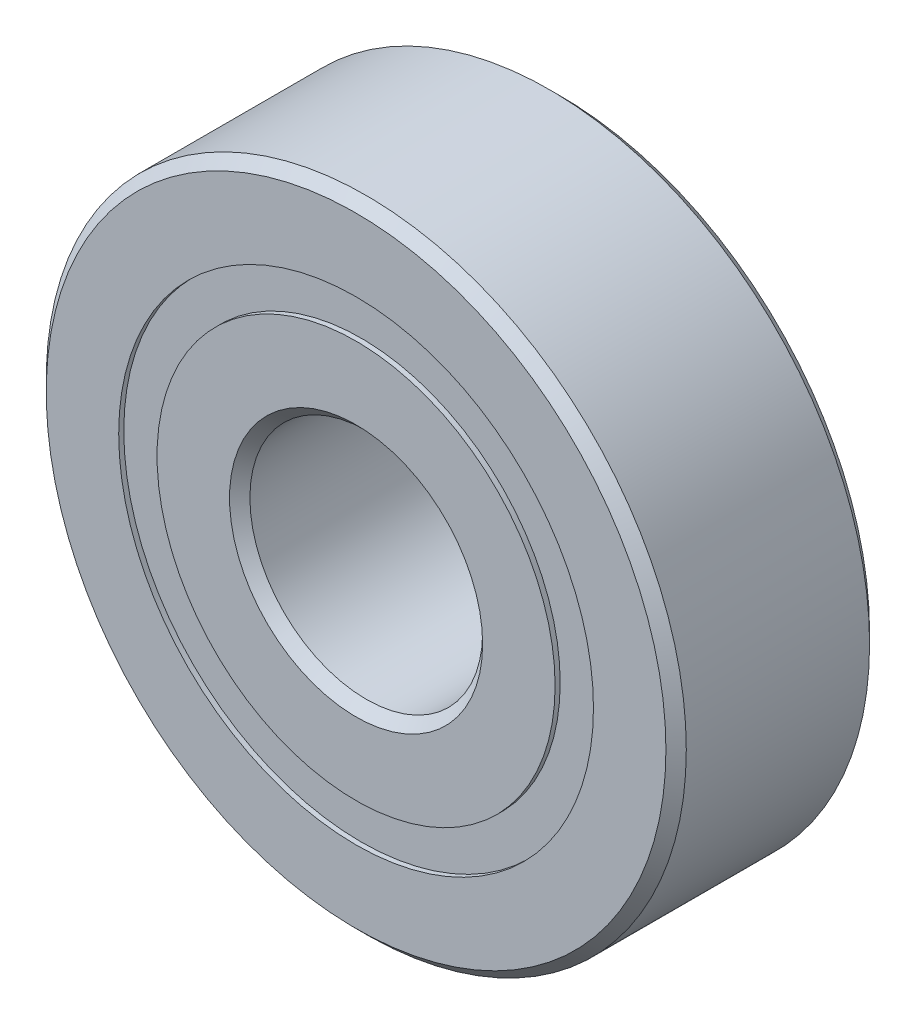
ISO-10303-21;
HEADER;
FILE_DESCRIPTION(('STEP AP214'),'2;1');
FILE_NAME('part.step','',(''),(''),'','','');
FILE_SCHEMA(('AUTOMOTIVE_DESIGN { 1 0 10303 214 1 1 1 1 }'));
ENDSEC;
DATA;
#1=APPLICATION_CONTEXT('core data for automotive mechanical design processes');
#2=APPLICATION_PROTOCOL_DEFINITION('international standard','automotive_design',2000,#1);
#3=PRODUCT_CONTEXT('',#1,'mechanical');
#4=PRODUCT('Part','Part','',(#3));
#5=PRODUCT_RELATED_PRODUCT_CATEGORY('part','',(#4));
#6=PRODUCT_DEFINITION_FORMATION('','',#4);
#7=PRODUCT_DEFINITION_CONTEXT('part definition',#1,'design');
#8=PRODUCT_DEFINITION('design','',#6,#7);
#9=PRODUCT_DEFINITION_SHAPE('','',#8);
#10=(LENGTH_UNIT() NAMED_UNIT(*) SI_UNIT(.MILLI.,.METRE.));
#11=(NAMED_UNIT(*) PLANE_ANGLE_UNIT() SI_UNIT($,.RADIAN.));
#12=(NAMED_UNIT(*) SI_UNIT($,.STERADIAN.) SOLID_ANGLE_UNIT());
#13=UNCERTAINTY_MEASURE_WITH_UNIT(LENGTH_MEASURE(1.E-05),#10,'distance_accuracy_value','');
#14=(GEOMETRIC_REPRESENTATION_CONTEXT(3) GLOBAL_UNCERTAINTY_ASSIGNED_CONTEXT((#13)) GLOBAL_UNIT_ASSIGNED_CONTEXT((#10,
#11,#12)) REPRESENTATION_CONTEXT('',''));
#15=CARTESIAN_POINT('',(0.,0.,0.));
#16=DIRECTION('',(0.,0.,1.));
#17=DIRECTION('',(1.,0.,0.));
#18=AXIS2_PLACEMENT_3D('',#15,#16,#17);
#19=CARTESIAN_POINT('',(0.,8.15934065934066,-3.325));
#20=DIRECTION('',(0.,0.,1.));
#21=DIRECTION('',(1.,0.,0.));
#22=AXIS2_PLACEMENT_3D('',#19,#20,#21);
#23=PLANE('',#22);
#24=CARTESIAN_POINT('',(0.,0.,-3.325));
#25=DIRECTION('',(0.,0.,1.));
#26=DIRECTION('',(1.,0.,0.));
#27=AXIS2_PLACEMENT_3D('',#24,#25,#26);
#28=CIRCLE('',#27,8.15934065934066);
#29=CARTESIAN_POINT('',(8.15934065934066,0.,-3.325));
#30=VERTEX_POINT('',#29);
#31=EDGE_CURVE('E57',#30,#30,#28,.T.);
#32=ORIENTED_EDGE('',*,*,#31,.F.);
#33=EDGE_LOOP('',(#32));
#34=FACE_BOUND('',#33,.T.);
#35=CARTESIAN_POINT('',(0.,0.,-3.325));
#36=DIRECTION('',(0.,0.,1.));
#37=DIRECTION('',(1.,0.,0.));
#38=AXIS2_PLACEMENT_3D('',#35,#36,#37);
#39=CIRCLE('',#38,6.84065934065934);
#40=CARTESIAN_POINT('',(6.84065934065934,0.,-3.325));
#41=VERTEX_POINT('',#40);
#42=EDGE_CURVE('E11',#41,#41,#39,.T.);
#43=ORIENTED_EDGE('',*,*,#42,.T.);
#44=EDGE_LOOP('',(#43));
#45=FACE_BOUND('',#44,.T.);
#46=ADVANCED_FACE('F43',(#34,#45),#23,.F.);
#47=CARTESIAN_POINT('',(0.,0.,3.5));
#48=DIRECTION('',(0.,0.,1.));
#49=DIRECTION('',(1.,0.,0.));
#50=AXIS2_PLACEMENT_3D('',#47,#48,#49);
#51=CYLINDRICAL_SURFACE('',#50,6.84065934065934);
#52=ORIENTED_EDGE('',*,*,#42,.F.);
#53=EDGE_LOOP('',(#52));
#54=FACE_BOUND('',#53,.T.);
#55=CARTESIAN_POINT('',(0.,0.,-1.68952158656808));
#56=DIRECTION('',(0.,0.,1.));
#57=DIRECTION('',(1.,0.,0.));
#58=AXIS2_PLACEMENT_3D('',#55,#56,#57);
#59=CIRCLE('',#58,6.84065934065934);
#60=CARTESIAN_POINT('',(6.84065934065934,0.,-1.68952158656808));
#61=VERTEX_POINT('',#60);
#62=EDGE_CURVE('E49',#61,#61,#59,.T.);
#63=ORIENTED_EDGE('',*,*,#62,.T.);
#64=EDGE_LOOP('',(#63));
#65=FACE_BOUND('',#64,.T.);
#66=ADVANCED_FACE('F66',(#54,#65),#51,.F.);
#67=CARTESIAN_POINT('',(0.,8.15934065934066,-1.68952158656808));
#68=DIRECTION('',(0.,0.,-1.));
#69=DIRECTION('',(-1.,0.,0.));
#70=AXIS2_PLACEMENT_3D('',#67,#68,#69);
#71=PLANE('',#70);
#72=ORIENTED_EDGE('',*,*,#62,.F.);
#73=EDGE_LOOP('',(#72));
#74=FACE_BOUND('',#73,.T.);
#75=CARTESIAN_POINT('',(0.,0.,-1.68952158656808));
#76=DIRECTION('',(0.,0.,1.));
#77=DIRECTION('',(1.,0.,0.));
#78=AXIS2_PLACEMENT_3D('',#75,#76,#77);
#79=CIRCLE('',#78,8.15934065934066);
#80=CARTESIAN_POINT('',(8.15934065934066,0.,-1.68952158656808));
#81=VERTEX_POINT('',#80);
#82=EDGE_CURVE('E53',#81,#81,#79,.T.);
#83=ORIENTED_EDGE('',*,*,#82,.T.);
#84=EDGE_LOOP('',(#83));
#85=FACE_BOUND('',#84,.T.);
#86=ADVANCED_FACE('F70',(#74,#85),#71,.F.);
#87=CARTESIAN_POINT('',(0.,0.,3.5));
#88=DIRECTION('',(0.,0.,1.));
#89=DIRECTION('',(1.,0.,0.));
#90=AXIS2_PLACEMENT_3D('',#87,#88,#89);
#91=CYLINDRICAL_SURFACE('',#90,8.15934065934066);
#92=ORIENTED_EDGE('',*,*,#82,.F.);
#93=EDGE_LOOP('',(#92));
#94=FACE_BOUND('',#93,.T.);
#95=ORIENTED_EDGE('',*,*,#31,.T.);
#96=EDGE_LOOP('',(#95));
#97=FACE_BOUND('',#96,.T.);
#98=ADVANCED_FACE('F63',(#94,#97),#91,.T.);
#99=CLOSED_SHELL('',(#46,#66,#86,#98));
#100=MANIFOLD_SOLID_BREP('B2',#99);
#101=CARTESIAN_POINT('',(0.,8.15934065934066,3.325));
#102=DIRECTION('',(0.,0.,-1.));
#103=DIRECTION('',(-1.,0.,0.));
#104=AXIS2_PLACEMENT_3D('',#101,#102,#103);
#105=PLANE('',#104);
#106=CARTESIAN_POINT('',(0.,0.,3.325));
#107=DIRECTION('',(0.,0.,1.));
#108=DIRECTION('',(1.,0.,0.));
#109=AXIS2_PLACEMENT_3D('',#106,#107,#108);
#110=CIRCLE('',#109,6.84065934065934);
#111=CARTESIAN_POINT('',(6.84065934065934,0.,3.325));
#112=VERTEX_POINT('',#111);
#113=EDGE_CURVE('E42',#112,#112,#110,.T.);
#114=ORIENTED_EDGE('',*,*,#113,.F.);
#115=EDGE_LOOP('',(#114));
#116=FACE_BOUND('',#115,.T.);
#117=CARTESIAN_POINT('',(0.,0.,3.325));
#118=DIRECTION('',(0.,0.,1.));
#119=DIRECTION('',(1.,0.,0.));
#120=AXIS2_PLACEMENT_3D('',#117,#118,#119);
#121=CIRCLE('',#120,8.15934065934066);
#122=CARTESIAN_POINT('',(8.15934065934066,0.,3.325));
#123=VERTEX_POINT('',#122);
#124=EDGE_CURVE('E124',#123,#123,#121,.T.);
#125=ORIENTED_EDGE('',*,*,#124,.T.);
#126=EDGE_LOOP('',(#125));
#127=FACE_BOUND('',#126,.T.);
#128=ADVANCED_FACE('F110',(#116,#127),#105,.F.);
#129=CARTESIAN_POINT('',(0.,0.,3.5));
#130=DIRECTION('',(0.,0.,1.));
#131=DIRECTION('',(1.,0.,0.));
#132=AXIS2_PLACEMENT_3D('',#129,#130,#131);
#133=CYLINDRICAL_SURFACE('',#132,6.84065934065934);
#134=CARTESIAN_POINT('',(0.,0.,1.68952158656808));
#135=DIRECTION('',(0.,0.,1.));
#136=DIRECTION('',(1.,0.,0.));
#137=AXIS2_PLACEMENT_3D('',#134,#135,#136);
#138=CIRCLE('',#137,6.84065934065934);
#139=CARTESIAN_POINT('',(6.84065934065934,0.,1.68952158656808));
#140=VERTEX_POINT('',#139);
#141=EDGE_CURVE('E116',#140,#140,#138,.T.);
#142=ORIENTED_EDGE('',*,*,#141,.F.);
#143=EDGE_LOOP('',(#142));
#144=FACE_BOUND('',#143,.T.);
#145=ORIENTED_EDGE('',*,*,#113,.T.);
#146=EDGE_LOOP('',(#145));
#147=FACE_BOUND('',#146,.T.);
#148=ADVANCED_FACE('F139',(#144,#147),#133,.F.);
#149=CARTESIAN_POINT('',(0.,8.15934065934066,1.68952158656808));
#150=DIRECTION('',(0.,0.,1.));
#151=DIRECTION('',(1.,0.,0.));
#152=AXIS2_PLACEMENT_3D('',#149,#150,#151);
#153=PLANE('',#152);
#154=CARTESIAN_POINT('',(0.,0.,1.68952158656808));
#155=DIRECTION('',(0.,0.,1.));
#156=DIRECTION('',(1.,0.,0.));
#157=AXIS2_PLACEMENT_3D('',#154,#155,#156);
#158=CIRCLE('',#157,8.15934065934066);
#159=CARTESIAN_POINT('',(8.15934065934066,0.,1.68952158656808));
#160=VERTEX_POINT('',#159);
#161=EDGE_CURVE('E120',#160,#160,#158,.T.);
#162=ORIENTED_EDGE('',*,*,#161,.F.);
#163=EDGE_LOOP('',(#162));
#164=FACE_BOUND('',#163,.T.);
#165=ORIENTED_EDGE('',*,*,#141,.T.);
#166=EDGE_LOOP('',(#165));
#167=FACE_BOUND('',#166,.T.);
#168=ADVANCED_FACE('F134',(#164,#167),#153,.F.);
#169=CARTESIAN_POINT('',(0.,0.,3.5));
#170=DIRECTION('',(0.,0.,1.));
#171=DIRECTION('',(1.,0.,0.));
#172=AXIS2_PLACEMENT_3D('',#169,#170,#171);
#173=CYLINDRICAL_SURFACE('',#172,8.15934065934066);
#174=ORIENTED_EDGE('',*,*,#124,.F.);
#175=EDGE_LOOP('',(#174));
#176=FACE_BOUND('',#175,.T.);
#177=ORIENTED_EDGE('',*,*,#161,.T.);
#178=EDGE_LOOP('',(#177));
#179=FACE_BOUND('',#178,.T.);
#180=ADVANCED_FACE('F131',(#176,#179),#173,.T.);
#181=CLOSED_SHELL('',(#128,#148,#168,#180));
#182=MANIFOLD_SOLID_BREP('B6',#181);
#183=CARTESIAN_POINT('',(-3.74999999999992,6.49519052838334,0.));
#184=DIRECTION('',(0.,0.,1.));
#185=DIRECTION('',(-0.499999999999989,0.866025403784445,0.));
#186=AXIS2_PLACEMENT_3D('',#183,#184,#185);
#187=SPHERICAL_SURFACE('',#186,1.68952158656808);
#188=CARTESIAN_POINT('',(-3.74999999999992,6.49519052838334,1.68952158656808));
#189=VERTEX_POINT('',#188);
#190=VERTEX_LOOP('',#189);
#191=FACE_BOUND('',#190,.T.);
#192=ADVANCED_FACE('F177',(#191),#187,.T.);
#193=CLOSED_SHELL('',(#192));
#194=MANIFOLD_SOLID_BREP('B37',#193);
#195=CARTESIAN_POINT('',(-6.49519052838325,3.75000000000008,0.));
#196=DIRECTION('',(0.,0.,1.));
#197=DIRECTION('',(-0.866025403784433,0.50000000000001,0.));
#198=AXIS2_PLACEMENT_3D('',#195,#196,#197);
#199=SPHERICAL_SURFACE('',#198,1.68952158656808);
#200=CARTESIAN_POINT('',(-6.49519052838325,3.75000000000008,1.68952158656808));
#201=VERTEX_POINT('',#200);
#202=VERTEX_LOOP('',#201);
#203=FACE_BOUND('',#202,.T.);
#204=ADVANCED_FACE('F197',(#203),#199,.T.);
#205=CLOSED_SHELL('',(#204));
#206=MANIFOLD_SOLID_BREP('B106',#205);
#207=CARTESIAN_POINT('',(-7.5,0.,0.));
#208=DIRECTION('',(0.,0.,1.));
#209=DIRECTION('',(-1.,0.,0.));
#210=AXIS2_PLACEMENT_3D('',#207,#208,#209);
#211=SPHERICAL_SURFACE('',#210,1.68952158656808);
#212=CARTESIAN_POINT('',(-7.5,0.,1.68952158656808));
#213=VERTEX_POINT('',#212);
#214=VERTEX_LOOP('',#213);
#215=FACE_BOUND('',#214,.T.);
#216=ADVANCED_FACE('F217',(#215),#211,.T.);
#217=CLOSED_SHELL('',(#216));
#218=MANIFOLD_SOLID_BREP('B173',#217);
#219=CARTESIAN_POINT('',(-6.49519052838332,-3.74999999999994,0.));
#220=DIRECTION('',(0.,0.,1.));
#221=DIRECTION('',(-0.866025403784443,-0.499999999999992,0.));
#222=AXIS2_PLACEMENT_3D('',#219,#220,#221);
#223=SPHERICAL_SURFACE('',#222,1.68952158656808);
#224=CARTESIAN_POINT('',(-6.49519052838332,-3.74999999999994,1.68952158656808));
#225=VERTEX_POINT('',#224);
#226=VERTEX_LOOP('',#225);
#227=FACE_BOUND('',#226,.T.);
#228=ADVANCED_FACE('F237',(#227),#223,.T.);
#229=CLOSED_SHELL('',(#228));
#230=MANIFOLD_SOLID_BREP('B193',#229);
#231=CARTESIAN_POINT('',(-3.75000000000005,-6.49519052838326,0.));
#232=DIRECTION('',(0.,0.,1.));
#233=DIRECTION('',(-0.500000000000007,-0.866025403784435,0.));
#234=AXIS2_PLACEMENT_3D('',#231,#232,#233);
#235=SPHERICAL_SURFACE('',#234,1.68952158656808);
#236=CARTESIAN_POINT('',(-3.75000000000005,-6.49519052838326,1.68952158656808));
#237=VERTEX_POINT('',#236);
#238=VERTEX_LOOP('',#237);
#239=FACE_BOUND('',#238,.T.);
#240=ADVANCED_FACE('F257',(#239),#235,.T.);
#241=CLOSED_SHELL('',(#240));
#242=MANIFOLD_SOLID_BREP('B213',#241);
#243=CARTESIAN_POINT('',(0.,-7.5,0.));
#244=DIRECTION('',(0.,0.,1.));
#245=DIRECTION('',(0.,-1.,0.));
#246=AXIS2_PLACEMENT_3D('',#243,#244,#245);
#247=SPHERICAL_SURFACE('',#246,1.68952158656808);
#248=CARTESIAN_POINT('',(0.,-7.5,1.68952158656808));
#249=VERTEX_POINT('',#248);
#250=VERTEX_LOOP('',#249);
#251=FACE_BOUND('',#250,.T.);
#252=ADVANCED_FACE('F277',(#251),#247,.T.);
#253=CLOSED_SHELL('',(#252));
#254=MANIFOLD_SOLID_BREP('B233',#253);
#255=CARTESIAN_POINT('',(3.74999999999996,-6.49519052838331,0.));
#256=DIRECTION('',(0.,0.,1.));
#257=DIRECTION('',(0.499999999999995,-0.866025403784442,0.));
#258=AXIS2_PLACEMENT_3D('',#255,#256,#257);
#259=SPHERICAL_SURFACE('',#258,1.68952158656808);
#260=CARTESIAN_POINT('',(3.74999999999996,-6.49519052838331,1.68952158656808));
#261=VERTEX_POINT('',#260);
#262=VERTEX_LOOP('',#261);
#263=FACE_BOUND('',#262,.T.);
#264=ADVANCED_FACE('F297',(#263),#259,.T.);
#265=CLOSED_SHELL('',(#264));
#266=MANIFOLD_SOLID_BREP('B253',#265);
#267=CARTESIAN_POINT('',(6.49519052838327,-3.75000000000003,0.));
#268=DIRECTION('',(0.,0.,1.));
#269=DIRECTION('',(0.866025403784436,-0.500000000000004,0.));
#270=AXIS2_PLACEMENT_3D('',#267,#268,#269);
#271=SPHERICAL_SURFACE('',#270,1.68952158656808);
#272=CARTESIAN_POINT('',(6.49519052838327,-3.75000000000003,1.68952158656808));
#273=VERTEX_POINT('',#272);
#274=VERTEX_LOOP('',#273);
#275=FACE_BOUND('',#274,.T.);
#276=ADVANCED_FACE('F317',(#275),#271,.T.);
#277=CLOSED_SHELL('',(#276));
#278=MANIFOLD_SOLID_BREP('B273',#277);
#279=CARTESIAN_POINT('',(7.5,0.,0.));
#280=DIRECTION('',(0.,0.,1.));
#281=DIRECTION('',(1.,0.,0.));
#282=AXIS2_PLACEMENT_3D('',#279,#280,#281);
#283=SPHERICAL_SURFACE('',#282,1.68952158656808);
#284=CARTESIAN_POINT('',(7.5,0.,1.68952158656808));
#285=VERTEX_POINT('',#284);
#286=VERTEX_LOOP('',#285);
#287=FACE_BOUND('',#286,.T.);
#288=ADVANCED_FACE('F337',(#287),#283,.T.);
#289=CLOSED_SHELL('',(#288));
#290=MANIFOLD_SOLID_BREP('B293',#289);
#291=CARTESIAN_POINT('',(6.4951905283833,3.74999999999998,0.));
#292=DIRECTION('',(0.,0.,1.));
#293=DIRECTION('',(0.86602540378444,0.499999999999998,0.));
#294=AXIS2_PLACEMENT_3D('',#291,#292,#293);
#295=SPHERICAL_SURFACE('',#294,1.68952158656808);
#296=CARTESIAN_POINT('',(6.4951905283833,3.74999999999998,1.68952158656808));
#297=VERTEX_POINT('',#296);
#298=VERTEX_LOOP('',#297);
#299=FACE_BOUND('',#298,.T.);
#300=ADVANCED_FACE('F357',(#299),#295,.T.);
#301=CLOSED_SHELL('',(#300));
#302=MANIFOLD_SOLID_BREP('B313',#301);
#303=CARTESIAN_POINT('',(3.75000000000001,6.49519052838328,0.));
#304=DIRECTION('',(0.,0.,1.));
#305=DIRECTION('',(0.500000000000001,0.866025403784438,0.));
#306=AXIS2_PLACEMENT_3D('',#303,#304,#305);
#307=SPHERICAL_SURFACE('',#306,1.68952158656808);
#308=CARTESIAN_POINT('',(3.75000000000001,6.49519052838328,1.68952158656808));
#309=VERTEX_POINT('',#308);
#310=VERTEX_LOOP('',#309);
#311=FACE_BOUND('',#310,.T.);
#312=ADVANCED_FACE('F377',(#311),#307,.T.);
#313=CLOSED_SHELL('',(#312));
#314=MANIFOLD_SOLID_BREP('B333',#313);
#315=CARTESIAN_POINT('',(0.,7.5,0.));
#316=DIRECTION('',(0.,0.,1.));
#317=DIRECTION('',(0.,1.,0.));
#318=AXIS2_PLACEMENT_3D('',#315,#316,#317);
#319=SPHERICAL_SURFACE('',#318,1.68952158656808);
#320=CARTESIAN_POINT('',(0.,7.5,1.68952158656808));
#321=VERTEX_POINT('',#320);
#322=VERTEX_LOOP('',#321);
#323=FACE_BOUND('',#322,.T.);
#324=ADVANCED_FACE('F399',(#323),#319,.T.);
#325=CLOSED_SHELL('',(#324));
#326=MANIFOLD_SOLID_BREP('B353',#325);
#327=CARTESIAN_POINT('',(0.,6.84065934065934,3.5));
#328=DIRECTION('',(0.,0.,-1.));
#329=DIRECTION('',(-1.,0.,0.));
#330=AXIS2_PLACEMENT_3D('',#327,#328,#329);
#331=PLANE('',#330);
#332=CARTESIAN_POINT('',(0.,0.,3.5));
#333=DIRECTION('',(0.,0.,1.));
#334=DIRECTION('',(1.,0.,0.));
#335=AXIS2_PLACEMENT_3D('',#332,#333,#334);
#336=CIRCLE('',#335,4.35);
#337=CARTESIAN_POINT('',(4.35,0.,3.5));
#338=VERTEX_POINT('',#337);
#339=EDGE_CURVE('E446',#338,#338,#336,.T.);
#340=ORIENTED_EDGE('',*,*,#339,.F.);
#341=EDGE_LOOP('',(#340));
#342=FACE_BOUND('',#341,.T.);
#343=CARTESIAN_POINT('',(0.,0.,3.5));
#344=DIRECTION('',(0.,0.,1.));
#345=DIRECTION('',(1.,0.,0.));
#346=AXIS2_PLACEMENT_3D('',#343,#344,#345);
#347=CIRCLE('',#346,6.84065934065934);
#348=CARTESIAN_POINT('',(6.84065934065934,0.,3.5));
#349=VERTEX_POINT('',#348);
#350=EDGE_CURVE('E398',#349,#349,#347,.T.);
#351=ORIENTED_EDGE('',*,*,#350,.T.);
#352=EDGE_LOOP('',(#351));
#353=FACE_BOUND('',#352,.T.);
#354=ADVANCED_FACE('F418',(#342,#353),#331,.F.);
#355=CARTESIAN_POINT('',(0.,0.,3.5));
#356=DIRECTION('',(0.,0.,1.));
#357=DIRECTION('',(1.,0.,0.));
#358=AXIS2_PLACEMENT_3D('',#355,#356,#357);
#359=CYLINDRICAL_SURFACE('',#358,6.84065934065934);
#360=ORIENTED_EDGE('',*,*,#350,.F.);
#361=EDGE_LOOP('',(#360));
#362=FACE_BOUND('',#361,.T.);
#363=CARTESIAN_POINT('',(0.,0.,1.55555555555556));
#364=DIRECTION('',(0.,0.,1.));
#365=DIRECTION('',(1.,0.,0.));
#366=AXIS2_PLACEMENT_3D('',#363,#364,#365);
#367=CIRCLE('',#366,6.84065934065934);
#368=CARTESIAN_POINT('',(6.84065934065934,0.,1.55555555555556));
#369=VERTEX_POINT('',#368);
#370=EDGE_CURVE('E424',#369,#369,#367,.T.);
#371=ORIENTED_EDGE('',*,*,#370,.T.);
#372=EDGE_LOOP('',(#371));
#373=FACE_BOUND('',#372,.T.);
#374=ADVANCED_FACE('F453',(#362,#373),#359,.T.);
#375=CARTESIAN_POINT('',(0.,0.,0.));
#376=DIRECTION('',(0.,0.,1.));
#377=DIRECTION('',(1.,0.,0.));
#378=AXIS2_PLACEMENT_3D('',#375,#376,#377);
#379=TOROIDAL_SURFACE('',#378,7.49999999999999,1.68952158656808);
#380=ORIENTED_EDGE('',*,*,#370,.F.);
#381=EDGE_LOOP('',(#380));
#382=FACE_BOUND('',#381,.T.);
#383=CARTESIAN_POINT('',(0.,0.,-1.55555555555556));
#384=DIRECTION('',(0.,0.,1.));
#385=DIRECTION('',(1.,0.,0.));
#386=AXIS2_PLACEMENT_3D('',#383,#384,#385);
#387=CIRCLE('',#386,6.84065934065934);
#388=CARTESIAN_POINT('',(6.84065934065934,0.,-1.55555555555556));
#389=VERTEX_POINT('',#388);
#390=EDGE_CURVE('E428',#389,#389,#387,.T.);
#391=ORIENTED_EDGE('',*,*,#390,.T.);
#392=EDGE_LOOP('',(#391));
#393=FACE_BOUND('',#392,.T.);
#394=ADVANCED_FACE('F457',(#382,#393),#379,.F.);
#395=CARTESIAN_POINT('',(0.,0.,3.5));
#396=DIRECTION('',(0.,0.,1.));
#397=DIRECTION('',(1.,0.,0.));
#398=AXIS2_PLACEMENT_3D('',#395,#396,#397);
#399=CYLINDRICAL_SURFACE('',#398,6.84065934065934);
#400=ORIENTED_EDGE('',*,*,#390,.F.);
#401=EDGE_LOOP('',(#400));
#402=FACE_BOUND('',#401,.T.);
#403=CARTESIAN_POINT('',(0.,0.,-3.5));
#404=DIRECTION('',(0.,0.,1.));
#405=DIRECTION('',(1.,0.,0.));
#406=AXIS2_PLACEMENT_3D('',#403,#404,#405);
#407=CIRCLE('',#406,6.84065934065934);
#408=CARTESIAN_POINT('',(6.84065934065934,0.,-3.5));
#409=VERTEX_POINT('',#408);
#410=EDGE_CURVE('E432',#409,#409,#407,.T.);
#411=ORIENTED_EDGE('',*,*,#410,.T.);
#412=EDGE_LOOP('',(#411));
#413=FACE_BOUND('',#412,.T.);
#414=ADVANCED_FACE('F462',(#402,#413),#399,.T.);
#415=CARTESIAN_POINT('',(0.,4.35,-3.5));
#416=DIRECTION('',(0.,0.,1.));
#417=DIRECTION('',(1.,0.,0.));
#418=AXIS2_PLACEMENT_3D('',#415,#416,#417);
#419=PLANE('',#418);
#420=ORIENTED_EDGE('',*,*,#410,.F.);
#421=EDGE_LOOP('',(#420));
#422=FACE_BOUND('',#421,.T.);
#423=CARTESIAN_POINT('',(0.,0.,-3.5));
#424=DIRECTION('',(0.,0.,1.));
#425=DIRECTION('',(1.,0.,0.));
#426=AXIS2_PLACEMENT_3D('',#423,#424,#425);
#427=CIRCLE('',#426,4.35);
#428=CARTESIAN_POINT('',(4.35,0.,-3.5));
#429=VERTEX_POINT('',#428);
#430=EDGE_CURVE('E437',#429,#429,#427,.T.);
#431=ORIENTED_EDGE('',*,*,#430,.T.);
#432=EDGE_LOOP('',(#431));
#433=FACE_BOUND('',#432,.T.);
#434=ADVANCED_FACE('F468',(#422,#433),#419,.F.);
#435=CARTESIAN_POINT('',(0.,0.,-3.15));
#436=DIRECTION('',(0.,0.,-1.));
#437=DIRECTION('',(-1.,0.,0.));
#438=AXIS2_PLACEMENT_3D('',#435,#436,#437);
#439=CONICAL_SURFACE('',#438,4.,0.785398163397451);
#440=ORIENTED_EDGE('',*,*,#430,.F.);
#441=EDGE_LOOP('',(#440));
#442=FACE_BOUND('',#441,.T.);
#443=CARTESIAN_POINT('',(0.,0.,-3.15));
#444=DIRECTION('',(0.,0.,1.));
#445=DIRECTION('',(1.,0.,0.));
#446=AXIS2_PLACEMENT_3D('',#443,#444,#445);
#447=CIRCLE('',#446,4.);
#448=CARTESIAN_POINT('',(4.,0.,-3.15));
#449=VERTEX_POINT('',#448);
#450=EDGE_CURVE('E440',#449,#449,#447,.T.);
#451=ORIENTED_EDGE('',*,*,#450,.T.);
#452=EDGE_LOOP('',(#451));
#453=FACE_BOUND('',#452,.T.);
#454=ADVANCED_FACE('F472',(#442,#453),#439,.F.);
#455=CARTESIAN_POINT('',(0.,0.,3.5));
#456=DIRECTION('',(0.,0.,1.));
#457=DIRECTION('',(1.,0.,0.));
#458=AXIS2_PLACEMENT_3D('',#455,#456,#457);
#459=CYLINDRICAL_SURFACE('',#458,4.);
#460=ORIENTED_EDGE('',*,*,#450,.F.);
#461=EDGE_LOOP('',(#460));
#462=FACE_BOUND('',#461,.T.);
#463=CARTESIAN_POINT('',(0.,0.,3.15));
#464=DIRECTION('',(0.,0.,1.));
#465=DIRECTION('',(1.,0.,0.));
#466=AXIS2_PLACEMENT_3D('',#463,#464,#465);
#467=CIRCLE('',#466,4.);
#468=CARTESIAN_POINT('',(4.,0.,3.15));
#469=VERTEX_POINT('',#468);
#470=EDGE_CURVE('E443',#469,#469,#467,.T.);
#471=ORIENTED_EDGE('',*,*,#470,.T.);
#472=EDGE_LOOP('',(#471));
#473=FACE_BOUND('',#472,.T.);
#474=ADVANCED_FACE('F476',(#462,#473),#459,.F.);
#475=CARTESIAN_POINT('',(0.,0.,3.5));
#476=DIRECTION('',(0.,0.,1.));
#477=DIRECTION('',(1.,0.,0.));
#478=AXIS2_PLACEMENT_3D('',#475,#476,#477);
#479=CONICAL_SURFACE('',#478,4.35,0.785398163397447);
#480=ORIENTED_EDGE('',*,*,#470,.F.);
#481=EDGE_LOOP('',(#480));
#482=FACE_BOUND('',#481,.T.);
#483=ORIENTED_EDGE('',*,*,#339,.T.);
#484=EDGE_LOOP('',(#483));
#485=FACE_BOUND('',#484,.T.);
#486=ADVANCED_FACE('F450',(#482,#485),#479,.F.);
#487=CLOSED_SHELL('',(#354,#374,#394,#414,#434,#454,#474,#486));
#488=MANIFOLD_SOLID_BREP('B373',#487);
#489=CARTESIAN_POINT('',(0.,0.,3.15));
#490=DIRECTION('',(0.,0.,-1.));
#491=DIRECTION('',(-1.,0.,0.));
#492=AXIS2_PLACEMENT_3D('',#489,#490,#491);
#493=CONICAL_SURFACE('',#492,11.,0.78539816339745);
#494=CARTESIAN_POINT('',(0.,0.,3.5));
#495=DIRECTION('',(0.,0.,1.));
#496=DIRECTION('',(1.,0.,0.));
#497=AXIS2_PLACEMENT_3D('',#494,#495,#496);
#498=CIRCLE('',#497,10.65);
#499=CARTESIAN_POINT('',(10.65,0.,3.5));
#500=VERTEX_POINT('',#499);
#501=EDGE_CURVE('E570',#500,#500,#498,.T.);
#502=ORIENTED_EDGE('',*,*,#501,.F.);
#503=EDGE_LOOP('',(#502));
#504=FACE_BOUND('',#503,.T.);
#505=CARTESIAN_POINT('',(0.,0.,3.15));
#506=DIRECTION('',(0.,0.,1.));
#507=DIRECTION('',(1.,0.,0.));
#508=AXIS2_PLACEMENT_3D('',#505,#506,#507);
#509=CIRCLE('',#508,11.);
#510=CARTESIAN_POINT('',(11.,0.,3.15));
#511=VERTEX_POINT('',#510);
#512=EDGE_CURVE('E417',#511,#511,#509,.T.);
#513=ORIENTED_EDGE('',*,*,#512,.T.);
#514=EDGE_LOOP('',(#513));
#515=FACE_BOUND('',#514,.T.);
#516=ADVANCED_FACE('F539',(#504,#515),#493,.T.);
#517=CARTESIAN_POINT('',(0.,0.,3.5));
#518=DIRECTION('',(0.,0.,1.));
#519=DIRECTION('',(1.,0.,0.));
#520=AXIS2_PLACEMENT_3D('',#517,#518,#519);
#521=CYLINDRICAL_SURFACE('',#520,11.);
#522=ORIENTED_EDGE('',*,*,#512,.F.);
#523=EDGE_LOOP('',(#522));
#524=FACE_BOUND('',#523,.T.);
#525=CARTESIAN_POINT('',(0.,0.,-3.15));
#526=DIRECTION('',(0.,0.,1.));
#527=DIRECTION('',(1.,0.,0.));
#528=AXIS2_PLACEMENT_3D('',#525,#526,#527);
#529=CIRCLE('',#528,11.);
#530=CARTESIAN_POINT('',(11.,0.,-3.15));
#531=VERTEX_POINT('',#530);
#532=EDGE_CURVE('E546',#531,#531,#529,.T.);
#533=ORIENTED_EDGE('',*,*,#532,.T.);
#534=EDGE_LOOP('',(#533));
#535=FACE_BOUND('',#534,.T.);
#536=ADVANCED_FACE('F577',(#524,#535),#521,.T.);
#537=CARTESIAN_POINT('',(0.,0.,-3.5));
#538=DIRECTION('',(0.,0.,1.));
#539=DIRECTION('',(1.,0.,0.));
#540=AXIS2_PLACEMENT_3D('',#537,#538,#539);
#541=CONICAL_SURFACE('',#540,10.65,0.785398163397448);
#542=ORIENTED_EDGE('',*,*,#532,.F.);
#543=EDGE_LOOP('',(#542));
#544=FACE_BOUND('',#543,.T.);
#545=CARTESIAN_POINT('',(0.,0.,-3.5));
#546=DIRECTION('',(0.,0.,1.));
#547=DIRECTION('',(1.,0.,0.));
#548=AXIS2_PLACEMENT_3D('',#545,#546,#547);
#549=CIRCLE('',#548,10.65);
#550=CARTESIAN_POINT('',(10.65,0.,-3.5));
#551=VERTEX_POINT('',#550);
#552=EDGE_CURVE('E552',#551,#551,#549,.T.);
#553=ORIENTED_EDGE('',*,*,#552,.T.);
#554=EDGE_LOOP('',(#553));
#555=FACE_BOUND('',#554,.T.);
#556=ADVANCED_FACE('F581',(#544,#555),#541,.T.);
#557=CARTESIAN_POINT('',(0.,10.65,-3.5));
#558=DIRECTION('',(0.,0.,1.));
#559=DIRECTION('',(1.,0.,0.));
#560=AXIS2_PLACEMENT_3D('',#557,#558,#559);
#561=PLANE('',#560);
#562=ORIENTED_EDGE('',*,*,#552,.F.);
#563=EDGE_LOOP('',(#562));
#564=FACE_BOUND('',#563,.T.);
#565=CARTESIAN_POINT('',(0.,0.,-3.5));
#566=DIRECTION('',(0.,0.,1.));
#567=DIRECTION('',(1.,0.,0.));
#568=AXIS2_PLACEMENT_3D('',#565,#566,#567);
#569=CIRCLE('',#568,8.15934065934066);
#570=CARTESIAN_POINT('',(8.15934065934066,0.,-3.5));
#571=VERTEX_POINT('',#570);
#572=EDGE_CURVE('E556',#571,#571,#569,.T.);
#573=ORIENTED_EDGE('',*,*,#572,.T.);
#574=EDGE_LOOP('',(#573));
#575=FACE_BOUND('',#574,.T.);
#576=ADVANCED_FACE('F586',(#564,#575),#561,.F.);
#577=CARTESIAN_POINT('',(0.,0.,3.5));
#578=DIRECTION('',(0.,0.,1.));
#579=DIRECTION('',(1.,0.,0.));
#580=AXIS2_PLACEMENT_3D('',#577,#578,#579);
#581=CYLINDRICAL_SURFACE('',#580,8.15934065934066);
#582=ORIENTED_EDGE('',*,*,#572,.F.);
#583=EDGE_LOOP('',(#582));
#584=FACE_BOUND('',#583,.T.);
#585=CARTESIAN_POINT('',(0.,0.,-1.55555555555556));
#586=DIRECTION('',(0.,0.,1.));
#587=DIRECTION('',(1.,0.,0.));
#588=AXIS2_PLACEMENT_3D('',#585,#586,#587);
#589=CIRCLE('',#588,8.15934065934066);
#590=CARTESIAN_POINT('',(8.15934065934066,0.,-1.55555555555556));
#591=VERTEX_POINT('',#590);
#592=EDGE_CURVE('E561',#591,#591,#589,.T.);
#593=ORIENTED_EDGE('',*,*,#592,.T.);
#594=EDGE_LOOP('',(#593));
#595=FACE_BOUND('',#594,.T.);
#596=ADVANCED_FACE('F592',(#584,#595),#581,.F.);
#597=CARTESIAN_POINT('',(0.,0.,0.));
#598=DIRECTION('',(0.,0.,1.));
#599=DIRECTION('',(1.,0.,0.));
#600=AXIS2_PLACEMENT_3D('',#597,#598,#599);
#601=TOROIDAL_SURFACE('',#600,7.5,1.68952158656808);
#602=ORIENTED_EDGE('',*,*,#592,.F.);
#603=EDGE_LOOP('',(#602));
#604=FACE_BOUND('',#603,.T.);
#605=CARTESIAN_POINT('',(0.,0.,1.55555555555556));
#606=DIRECTION('',(0.,0.,1.));
#607=DIRECTION('',(1.,0.,0.));
#608=AXIS2_PLACEMENT_3D('',#605,#606,#607);
#609=CIRCLE('',#608,8.15934065934066);
#610=CARTESIAN_POINT('',(8.15934065934066,0.,1.55555555555556));
#611=VERTEX_POINT('',#610);
#612=EDGE_CURVE('E564',#611,#611,#609,.T.);
#613=ORIENTED_EDGE('',*,*,#612,.T.);
#614=EDGE_LOOP('',(#613));
#615=FACE_BOUND('',#614,.T.);
#616=ADVANCED_FACE('F596',(#604,#615),#601,.F.);
#617=CARTESIAN_POINT('',(0.,0.,3.5));
#618=DIRECTION('',(0.,0.,1.));
#619=DIRECTION('',(1.,0.,0.));
#620=AXIS2_PLACEMENT_3D('',#617,#618,#619);
#621=CYLINDRICAL_SURFACE('',#620,8.15934065934066);
#622=ORIENTED_EDGE('',*,*,#612,.F.);
#623=EDGE_LOOP('',(#622));
#624=FACE_BOUND('',#623,.T.);
#625=CARTESIAN_POINT('',(0.,0.,3.5));
#626=DIRECTION('',(0.,0.,1.));
#627=DIRECTION('',(1.,0.,0.));
#628=AXIS2_PLACEMENT_3D('',#625,#626,#627);
#629=CIRCLE('',#628,8.15934065934066);
#630=CARTESIAN_POINT('',(8.15934065934066,0.,3.5));
#631=VERTEX_POINT('',#630);
#632=EDGE_CURVE('E567',#631,#631,#629,.T.);
#633=ORIENTED_EDGE('',*,*,#632,.T.);
#634=EDGE_LOOP('',(#633));
#635=FACE_BOUND('',#634,.T.);
#636=ADVANCED_FACE('F600',(#624,#635),#621,.F.);
#637=CARTESIAN_POINT('',(0.,10.65,3.5));
#638=DIRECTION('',(0.,0.,-1.));
#639=DIRECTION('',(-1.,0.,0.));
#640=AXIS2_PLACEMENT_3D('',#637,#638,#639);
#641=PLANE('',#640);
#642=ORIENTED_EDGE('',*,*,#632,.F.);
#643=EDGE_LOOP('',(#642));
#644=FACE_BOUND('',#643,.T.);
#645=ORIENTED_EDGE('',*,*,#501,.T.);
#646=EDGE_LOOP('',(#645));
#647=FACE_BOUND('',#646,.T.);
#648=ADVANCED_FACE('F574',(#644,#647),#641,.F.);
#649=CLOSED_SHELL('',(#516,#536,#556,#576,#596,#616,#636,#648));
#650=MANIFOLD_SOLID_BREP('B393',#649);
#651=ADVANCED_BREP_SHAPE_REPRESENTATION('',(#18,#100,#182,#194,#206,#218,#230,#242,#254,#266,
#278,#290,#302,#314,#326,#488,#650),#14);
#652=SHAPE_DEFINITION_REPRESENTATION(#9,#651);
ENDSEC;
END-ISO-10303-21;
